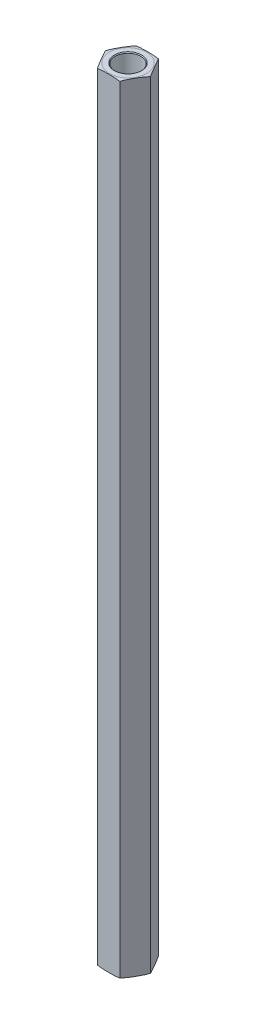
ISO-10303-21;
HEADER;
FILE_DESCRIPTION(('STEP AP214'),'2;1');
FILE_NAME('part.step','',(''),(''),'','','');
FILE_SCHEMA(('AUTOMOTIVE_DESIGN { 1 0 10303 214 1 1 1 1 }'));
ENDSEC;
DATA;
#1=APPLICATION_CONTEXT('core data for automotive mechanical design processes');
#2=APPLICATION_PROTOCOL_DEFINITION('international standard','automotive_design',2000,#1);
#3=PRODUCT_CONTEXT('',#1,'mechanical');
#4=PRODUCT('Part','Part','',(#3));
#5=PRODUCT_RELATED_PRODUCT_CATEGORY('part','',(#4));
#6=PRODUCT_DEFINITION_FORMATION('','',#4);
#7=PRODUCT_DEFINITION_CONTEXT('part definition',#1,'design');
#8=PRODUCT_DEFINITION('design','',#6,#7);
#9=PRODUCT_DEFINITION_SHAPE('','',#8);
#10=(LENGTH_UNIT() NAMED_UNIT(*) SI_UNIT(.MILLI.,.METRE.));
#11=(NAMED_UNIT(*) PLANE_ANGLE_UNIT() SI_UNIT($,.RADIAN.));
#12=(NAMED_UNIT(*) SI_UNIT($,.STERADIAN.) SOLID_ANGLE_UNIT());
#13=UNCERTAINTY_MEASURE_WITH_UNIT(LENGTH_MEASURE(1.E-05),#10,'distance_accuracy_value','');
#14=(GEOMETRIC_REPRESENTATION_CONTEXT(3) GLOBAL_UNCERTAINTY_ASSIGNED_CONTEXT((#13)) GLOBAL_UNIT_ASSIGNED_CONTEXT((#10,
#11,#12)) REPRESENTATION_CONTEXT('',''));
#15=CARTESIAN_POINT('',(0.,0.,0.));
#16=DIRECTION('',(0.,0.,1.));
#17=DIRECTION('',(1.,0.,0.));
#18=AXIS2_PLACEMENT_3D('',#15,#16,#17);
#19=CARTESIAN_POINT('',(0.,50.8,0.));
#20=DIRECTION('',(0.,1.,0.));
#21=DIRECTION('',(0.,0.,1.));
#22=AXIS2_PLACEMENT_3D('',#19,#20,#21);
#23=PLANE('',#22);
#24=CARTESIAN_POINT('',(0.,50.8,0.));
#25=DIRECTION('',(0.,1.,0.));
#26=DIRECTION('',(0.,0.,1.));
#27=AXIS2_PLACEMENT_3D('',#24,#25,#26);
#28=CIRCLE('',#27,2.0955);
#29=CARTESIAN_POINT('',(0.,50.8,2.0955));
#30=VERTEX_POINT('',#29);
#31=EDGE_CURVE('E303',#30,#30,#28,.T.);
#32=ORIENTED_EDGE('',*,*,#31,.T.);
#33=EDGE_LOOP('',(#32));
#34=FACE_BOUND('',#33,.T.);
#35=ADVANCED_FACE('F17',(#34),#23,.T.);
#36=CARTESIAN_POINT('',(0.,-50.8,0.));
#37=DIRECTION('',(0.,-1.,0.));
#38=DIRECTION('',(0.,0.,-1.));
#39=AXIS2_PLACEMENT_3D('',#36,#37,#38);
#40=PLANE('',#39);
#41=CARTESIAN_POINT('',(0.,-50.8,0.));
#42=DIRECTION('',(0.,-1.,0.));
#43=DIRECTION('',(0.,0.,-1.));
#44=AXIS2_PLACEMENT_3D('',#41,#42,#43);
#45=CIRCLE('',#44,2.0955);
#46=CARTESIAN_POINT('',(0.,-50.8,-2.0955));
#47=VERTEX_POINT('',#46);
#48=EDGE_CURVE('E437',#47,#47,#45,.T.);
#49=ORIENTED_EDGE('',*,*,#48,.T.);
#50=EDGE_LOOP('',(#49));
#51=FACE_BOUND('',#50,.T.);
#52=ADVANCED_FACE('F408',(#51),#40,.T.);
#53=CARTESIAN_POINT('',(0.,50.8,0.));
#54=DIRECTION('',(0.,1.,0.));
#55=DIRECTION('',(0.,0.,1.));
#56=AXIS2_PLACEMENT_3D('',#53,#54,#55);
#57=CYLINDRICAL_SURFACE('',#56,2.0955);
#58=CARTESIAN_POINT('',(0.,63.3729999999559,0.));
#59=DIRECTION('',(0.,1.,0.));
#60=DIRECTION('',(0.,0.,1.));
#61=AXIS2_PLACEMENT_3D('',#58,#59,#60);
#62=CIRCLE('',#61,2.09549999993897);
#63=CARTESIAN_POINT('',(0.,63.3729999999559,2.09549999993897));
#64=VERTEX_POINT('',#63);
#65=EDGE_CURVE('E439',#64,#64,#62,.T.);
#66=ORIENTED_EDGE('',*,*,#65,.T.);
#67=EDGE_LOOP('',(#66));
#68=FACE_BOUND('',#67,.T.);
#69=ORIENTED_EDGE('',*,*,#31,.F.);
#70=EDGE_LOOP('',(#69));
#71=FACE_BOUND('',#70,.T.);
#72=ADVANCED_FACE('F398',(#68,#71),#57,.F.);
#73=CARTESIAN_POINT('',(0.,-50.8,0.));
#74=DIRECTION('',(0.,-1.,0.));
#75=DIRECTION('',(0.,0.,-1.));
#76=AXIS2_PLACEMENT_3D('',#73,#74,#75);
#77=CYLINDRICAL_SURFACE('',#76,2.0955);
#78=ORIENTED_EDGE('',*,*,#48,.F.);
#79=EDGE_LOOP('',(#78));
#80=FACE_BOUND('',#79,.T.);
#81=CARTESIAN_POINT('',(0.,-63.3730000000128,0.));
#82=DIRECTION('',(0.,-1.,0.));
#83=DIRECTION('',(0.,0.,-1.));
#84=AXIS2_PLACEMENT_3D('',#81,#82,#83);
#85=CIRCLE('',#84,2.09550000005265);
#86=CARTESIAN_POINT('',(0.,-63.3730000000128,-2.09550000005265));
#87=VERTEX_POINT('',#86);
#88=EDGE_CURVE('E156',#87,#87,#85,.T.);
#89=ORIENTED_EDGE('',*,*,#88,.T.);
#90=EDGE_LOOP('',(#89));
#91=FACE_BOUND('',#90,.T.);
#92=ADVANCED_FACE('F388',(#80,#91),#77,.F.);
#93=CARTESIAN_POINT('',(0.,63.4999999999764,0.));
#94=DIRECTION('',(0.,1.,0.));
#95=DIRECTION('',(0.,0.,1.));
#96=AXIS2_PLACEMENT_3D('',#93,#94,#95);
#97=CONICAL_SURFACE('',#96,2.22249999995938,0.785398163397448);
#98=CARTESIAN_POINT('',(0.,63.5000000000332,0.));
#99=DIRECTION('',(0.,1.,0.));
#100=DIRECTION('',(0.,0.,1.));
#101=AXIS2_PLACEMENT_3D('',#98,#99,#100);
#102=CIRCLE('',#101,2.22250000001623);
#103=CARTESIAN_POINT('',(0.,63.5000000000332,2.22250000001623));
#104=VERTEX_POINT('',#103);
#105=EDGE_CURVE('E300',#104,#104,#102,.T.);
#106=ORIENTED_EDGE('',*,*,#105,.T.);
#107=EDGE_LOOP('',(#106));
#108=FACE_BOUND('',#107,.T.);
#109=ORIENTED_EDGE('',*,*,#65,.F.);
#110=EDGE_LOOP('',(#109));
#111=FACE_BOUND('',#110,.T.);
#112=ADVANCED_FACE('F323',(#108,#111),#97,.F.);
#113=CARTESIAN_POINT('',(3.66617420935412,63.5,0.));
#114=DIRECTION('',(-0.866025403784439,0.,0.5));
#115=DIRECTION('',(0.5,0.,0.866025403784439));
#116=AXIS2_PLACEMENT_3D('',#113,#114,#115);
#117=PLANE('',#116);
#118=DIRECTION('',(0.,1.,0.));
#119=VECTOR('',#118,1.);
#120=CARTESIAN_POINT('',(1.83308710467706,63.5,-3.175));
#121=LINE('',#120,#119);
#122=CARTESIAN_POINT('',(1.83308710467706,-63.373,-3.175));
#123=VERTEX_POINT('',#122);
#124=CARTESIAN_POINT('',(1.83308710467706,63.373,-3.175));
#125=VERTEX_POINT('',#124);
#126=EDGE_CURVE('E79',#123,#125,#121,.T.);
#127=ORIENTED_EDGE('',*,*,#126,.T.);
#128=CARTESIAN_POINT('',(3.66617420935412,63.373,0.));
#129=CARTESIAN_POINT('',(3.62797961467394,63.3889014148997,-0.0661549785605575));
#130=CARTESIAN_POINT('',(3.58956810864157,63.4024886076105,-0.132685658603875));
#131=CARTESIAN_POINT('',(3.51249051795711,63.4258161979402,-0.266187961794358));
#132=CARTESIAN_POINT('',(3.47382473049846,63.4355604771397,-0.333159070187389));
#133=CARTESIAN_POINT('',(3.39641631867873,63.4519966530451,-0.46723437239238));
#134=CARTESIAN_POINT('',(3.35767399633312,63.4586945328669,-0.534338043098183));
#135=CARTESIAN_POINT('',(3.28009834620113,63.4697767572932,-0.66870301055698));
#136=CARTESIAN_POINT('',(3.24126499587771,63.474160450474,-0.735964346345267));
#137=CARTESIAN_POINT('',(3.16354065964315,63.4812403004263,-0.870586845688097));
#138=CARTESIAN_POINT('',(3.12464965374476,63.4839355237591,-0.937948043861568));
#139=CARTESIAN_POINT('',(3.04685144594593,63.4881531983714,-1.07269849250694));
#140=CARTESIAN_POINT('',(3.00794424351969,63.4896756080272,-1.14008774388955));
#141=CARTESIAN_POINT('',(2.93051517598873,63.491922705889,-1.27419882283586));
#142=CARTESIAN_POINT('',(2.89199336248934,63.4926552468181,-1.34092056101649));
#143=CARTESIAN_POINT('',(2.81494778346144,63.4935767302574,-1.47436741839139));
#144=CARTESIAN_POINT('',(2.77642401791439,63.4937656658949,-1.54109253761774));
#145=CARTESIAN_POINT('',(2.69935964431012,63.4936659966806,-1.6745719481538));
#146=CARTESIAN_POINT('',(2.66081903631821,63.4933771811766,-1.74132623935039));
#147=CARTESIAN_POINT('',(2.5837390808533,63.492221986219,-1.87483263846077));
#148=CARTESIAN_POINT('',(2.54519973341245,63.4913555970386,-1.94158474631886));
#149=CARTESIAN_POINT('',(2.46812969629771,63.4887861940656,-2.07507396634282));
#150=CARTESIAN_POINT('',(2.42959900625965,63.4870832271616,-2.14181107913942));
#151=CARTESIAN_POINT('',(2.35255651340908,63.4824387229726,-2.27525259109836));
#152=CARTESIAN_POINT('',(2.31404470975443,63.4794972471358,-2.34195699171935));
#153=CARTESIAN_POINT('',(2.25084206239945,63.4732174124749,-2.45142718811103));
#154=CARTESIAN_POINT('',(2.2261384933701,63.4703980110463,-2.49421502479815));
#155=CARTESIAN_POINT('',(2.17676945272228,63.4638696794304,-2.57972471152111));
#156=CARTESIAN_POINT('',(2.15210397034183,63.4601610809139,-2.62244658019723));
#157=CARTESIAN_POINT('',(2.10282753811696,63.4516802711497,-2.70779586442644));
#158=CARTESIAN_POINT('',(2.07821657107529,63.4469084657008,-2.75042330976602));
#159=CARTESIAN_POINT('',(2.02900094683549,63.4360987712516,-2.83566727147556));
#160=CARTESIAN_POINT('',(2.00439646085463,63.4300577313084,-2.87828349128853));
#161=CARTESIAN_POINT('',(1.95527325900933,63.4165138354161,-2.96336737271505));
#162=CARTESIAN_POINT('',(1.93075459617614,63.409010197803,-3.00583494247579));
#163=CARTESIAN_POINT('',(1.88182157373171,63.3923203507084,-3.09058942351745));
#164=CARTESIAN_POINT('',(1.85740744053269,63.3831314978033,-3.1328759426409));
#165=CARTESIAN_POINT('',(1.83308710467706,63.373,-3.175));
#166=B_SPLINE_CURVE_WITH_KNOTS('',3,(#128,#129,#130,#131,#132,#133,#134,#135,#136,#137,#138,
#139,#140,#141,#142,#143,#144,#145,#146,#147,#148,#149,#150,#151,#152,#153,#154,#155,#156,#157,
#158,#159,#160,#161,#162,#163,#164,#165),.UNSPECIFIED.,.F.,.F.,(4,2,2,2,2,2,2,2,2,2,2,2,2,2,2,2,
2,2,4),(0.,0.233977307817942,0.467717675040691,0.700996973557496,0.934341903229746,
1.16781571967239,1.40129782179824,1.63243665809669,1.86357841666616,2.09482211846293,
2.32606971471494,2.55730435147396,2.78852751694412,2.93698369265086,3.08538458004473,
3.23372892334584,3.38244598546612,3.53124274626084,3.68027493713585),.UNSPECIFIED.);
#167=CARTESIAN_POINT('',(3.66617420935412,63.373,0.));
#168=VERTEX_POINT('',#167);
#169=EDGE_CURVE('E72',#168,#125,#166,.T.);
#170=ORIENTED_EDGE('',*,*,#169,.F.);
#171=DIRECTION('',(0.,1.,0.));
#172=VECTOR('',#171,1.);
#173=CARTESIAN_POINT('',(3.66617420935412,63.5,0.));
#174=LINE('',#173,#172);
#175=CARTESIAN_POINT('',(3.66617420935412,-63.373,0.));
#176=VERTEX_POINT('',#175);
#177=EDGE_CURVE('E76',#168,#176,#174,.F.);
#178=ORIENTED_EDGE('',*,*,#177,.T.);
#179=CARTESIAN_POINT('',(1.83308710467706,-63.373,-3.17499999999999));
#180=CARTESIAN_POINT('',(1.87128169935724,-63.3889014148997,-3.10884502143943));
#181=CARTESIAN_POINT('',(1.90969320538961,-63.4024886076105,-3.04231434139611));
#182=CARTESIAN_POINT('',(1.98677079607407,-63.4258161979402,-2.90881203820563));
#183=CARTESIAN_POINT('',(2.02543658353272,-63.4355604771397,-2.8418409298126));
#184=CARTESIAN_POINT('',(2.10284499535245,-63.4519966530451,-2.70776562760761));
#185=CARTESIAN_POINT('',(2.14158731769806,-63.4586945328669,-2.6406619569018));
#186=CARTESIAN_POINT('',(2.21916296783005,-63.4697767572932,-2.50629698944301));
#187=CARTESIAN_POINT('',(2.25799631815347,-63.474160450474,-2.43903565365472));
#188=CARTESIAN_POINT('',(2.33572065438804,-63.4812403004263,-2.30441315431189));
#189=CARTESIAN_POINT('',(2.37461166028642,-63.4839355237591,-2.23705195613842));
#190=CARTESIAN_POINT('',(2.45240986808526,-63.4881531983714,-2.10230150749304));
#191=CARTESIAN_POINT('',(2.49131707051149,-63.4896756080272,-2.03491225611043));
#192=CARTESIAN_POINT('',(2.56874613804245,-63.491922705889,-1.90080117716413));
#193=CARTESIAN_POINT('',(2.60726795154184,-63.4926552468181,-1.8340794389835));
#194=CARTESIAN_POINT('',(2.68431353056975,-63.4935767302574,-1.70063258160859));
#195=CARTESIAN_POINT('',(2.72283729611679,-63.4937656658949,-1.63390746238224));
#196=CARTESIAN_POINT('',(2.79990166972106,-63.4936659966806,-1.50042805184618));
#197=CARTESIAN_POINT('',(2.83844227771297,-63.4933771811766,-1.4336737606496));
#198=CARTESIAN_POINT('',(2.91552223317789,-63.492221986219,-1.30016736153921));
#199=CARTESIAN_POINT('',(2.95406158061873,-63.4913555970386,-1.23341525368112));
#200=CARTESIAN_POINT('',(3.03113161773348,-63.4887861940656,-1.09992603365716));
#201=CARTESIAN_POINT('',(3.06966230777154,-63.4870832271616,-1.03318892086056));
#202=CARTESIAN_POINT('',(3.1467048006221,-63.4824387229726,-0.899747408901616));
#203=CARTESIAN_POINT('',(3.18521660427676,-63.4794972471358,-0.833043008280631));
#204=CARTESIAN_POINT('',(3.24841925163174,-63.4732174124749,-0.723572811888948));
#205=CARTESIAN_POINT('',(3.27312282066109,-63.4703980110463,-0.680784975201834));
#206=CARTESIAN_POINT('',(3.32249186130891,-63.4638696794304,-0.595275288478877));
#207=CARTESIAN_POINT('',(3.34715734368935,-63.4601610809139,-0.552553419802754));
#208=CARTESIAN_POINT('',(3.39643377591422,-63.4516802711497,-0.467204135573548));
#209=CARTESIAN_POINT('',(3.42104474295589,-63.4469084657008,-0.424576690233975));
#210=CARTESIAN_POINT('',(3.47026036719568,-63.4360987712516,-0.339332728524437));
#211=CARTESIAN_POINT('',(3.49486485317655,-63.4300577313084,-0.296716508711467));
#212=CARTESIAN_POINT('',(3.54398805502185,-63.4165138354161,-0.211632627284948));
#213=CARTESIAN_POINT('',(3.56850671785504,-63.409010197803,-0.169165057524209));
#214=CARTESIAN_POINT('',(3.61743974029946,-63.3923203507084,-0.0844105764825525));
#215=CARTESIAN_POINT('',(3.64185387349848,-63.3831314978033,-0.0421240573591055));
#216=CARTESIAN_POINT('',(3.66617420935411,-63.373,0.));
#217=B_SPLINE_CURVE_WITH_KNOTS('',3,(#179,#180,#181,#182,#183,#184,#185,#186,#187,#188,#189,
#190,#191,#192,#193,#194,#195,#196,#197,#198,#199,#200,#201,#202,#203,#204,#205,#206,#207,#208,
#209,#210,#211,#212,#213,#214,#215,#216),.UNSPECIFIED.,.F.,.F.,(4,2,2,2,2,2,2,2,2,2,2,2,2,2,2,2,
2,2,4),(0.,0.233977307817943,0.467717675040694,0.7009969735575,0.934341903229751,
1.1678157196724,1.40129782179824,1.6324366580967,1.86357841666617,2.09482211846294,
2.32606971471495,2.55730435147398,2.78852751694413,2.93698369265087,3.08538458004473,
3.23372892334584,3.38244598546612,3.53124274626083,3.68027493713583),.UNSPECIFIED.);
#218=EDGE_CURVE('E90',#123,#176,#217,.T.);
#219=ORIENTED_EDGE('',*,*,#218,.F.);
#220=EDGE_LOOP('',(#127,#170,#178,#219));
#221=FACE_BOUND('',#220,.T.);
#222=ADVANCED_FACE('F74',(#221),#117,.F.);
#223=CARTESIAN_POINT('',(0.,-63.4999999999195,0.));
#224=DIRECTION('',(0.,-1.,0.));
#225=DIRECTION('',(0.,0.,-1.));
#226=AXIS2_PLACEMENT_3D('',#223,#224,#225);
#227=CONICAL_SURFACE('',#226,2.22249999995938,0.785398163397448);
#228=ORIENTED_EDGE('',*,*,#88,.F.);
#229=EDGE_LOOP('',(#228));
#230=FACE_BOUND('',#229,.T.);
#231=CARTESIAN_POINT('',(0.,-63.4999999999764,0.));
#232=DIRECTION('',(0.,-1.,0.));
#233=DIRECTION('',(0.,0.,-1.));
#234=AXIS2_PLACEMENT_3D('',#231,#232,#233);
#235=CIRCLE('',#234,2.22250000001623);
#236=CARTESIAN_POINT('',(0.,-63.4999999999764,-2.22250000001623));
#237=VERTEX_POINT('',#236);
#238=EDGE_CURVE('E280',#237,#237,#235,.F.);
#239=ORIENTED_EDGE('',*,*,#238,.F.);
#240=EDGE_LOOP('',(#239));
#241=FACE_BOUND('',#240,.T.);
#242=ADVANCED_FACE('F315',(#230,#241),#227,.F.);
#243=CARTESIAN_POINT('',(-1.83308710467707,63.5,-3.175));
#244=DIRECTION('',(0.,-1.,0.));
#245=DIRECTION('',(0.,0.,-1.));
#246=AXIS2_PLACEMENT_3D('',#243,#244,#245);
#247=PLANE('',#246);
#248=CARTESIAN_POINT('',(0.,63.5,0.));
#249=DIRECTION('',(0.,-1.,0.));
#250=DIRECTION('',(0.,0.,1.));
#251=AXIS2_PLACEMENT_3D('',#248,#249,#250);
#252=CIRCLE('',#251,3.03117420935412);
#253=CARTESIAN_POINT('',(0.,63.5,3.03117420935412));
#254=VERTEX_POINT('',#253);
#255=CARTESIAN_POINT('',(0.,63.5,-3.03117420935412));
#256=VERTEX_POINT('',#255);
#257=EDGE_CURVE('E132',#254,#256,#252,.T.);
#258=ORIENTED_EDGE('',*,*,#257,.F.);
#259=CARTESIAN_POINT('',(0.,63.5,0.));
#260=DIRECTION('',(0.,-1.,0.));
#261=DIRECTION('',(0.,0.,-1.));
#262=AXIS2_PLACEMENT_3D('',#259,#260,#261);
#263=CIRCLE('',#262,3.03117420935412);
#264=EDGE_CURVE('E83',#256,#254,#263,.T.);
#265=ORIENTED_EDGE('',*,*,#264,.F.);
#266=EDGE_LOOP('',(#258,#265));
#267=FACE_BOUND('',#266,.T.);
#268=ORIENTED_EDGE('',*,*,#105,.F.);
#269=EDGE_LOOP('',(#268));
#270=FACE_BOUND('',#269,.T.);
#271=ADVANCED_FACE('F118',(#267,#270),#247,.F.);
#272=CARTESIAN_POINT('',(1.83308710467706,63.5,3.17499999999999));
#273=DIRECTION('',(-0.866025403784439,0.,-0.5));
#274=DIRECTION('',(-0.5,0.,0.866025403784439));
#275=AXIS2_PLACEMENT_3D('',#272,#273,#274);
#276=PLANE('',#275);
#277=ORIENTED_EDGE('',*,*,#177,.F.);
#278=CARTESIAN_POINT('',(1.83308710467706,63.373,3.17499999999999));
#279=CARTESIAN_POINT('',(1.87128169935724,63.3889014148997,3.10884502143944));
#280=CARTESIAN_POINT('',(1.90969320538961,63.4024886076105,3.04231434139612));
#281=CARTESIAN_POINT('',(1.98677079607407,63.4258161979402,2.90881203820563));
#282=CARTESIAN_POINT('',(2.02543658353272,63.4355604771397,2.8418409298126));
#283=CARTESIAN_POINT('',(2.10284499535245,63.4519966530451,2.70776562760761));
#284=CARTESIAN_POINT('',(2.14158731769806,63.4586945328669,2.64066195690181));
#285=CARTESIAN_POINT('',(2.21916296783005,63.4697767572932,2.50629698944301));
#286=CARTESIAN_POINT('',(2.25799631815347,63.474160450474,2.43903565365473));
#287=CARTESIAN_POINT('',(2.33572065438803,63.4812403004263,2.3044131543119));
#288=CARTESIAN_POINT('',(2.37461166028642,63.4839355237591,2.23705195613843));
#289=CARTESIAN_POINT('',(2.45240986808525,63.4881531983714,2.10230150749305));
#290=CARTESIAN_POINT('',(2.49131707051149,63.4896756080272,2.03491225611044));
#291=CARTESIAN_POINT('',(2.56874613804245,63.491922705889,1.90080117716414));
#292=CARTESIAN_POINT('',(2.60726795154184,63.4926552468181,1.83407943898351));
#293=CARTESIAN_POINT('',(2.68431353056974,63.4935767302574,1.7006325816086));
#294=CARTESIAN_POINT('',(2.72283729611679,63.4937656658949,1.63390746238225));
#295=CARTESIAN_POINT('',(2.79990166972106,63.4936659966806,1.50042805184619));
#296=CARTESIAN_POINT('',(2.83844227771297,63.4933771811766,1.43367376064961));
#297=CARTESIAN_POINT('',(2.91552223317788,63.492221986219,1.30016736153923));
#298=CARTESIAN_POINT('',(2.95406158061873,63.4913555970386,1.23341525368113));
#299=CARTESIAN_POINT('',(3.03113161773347,63.4887861940656,1.09992603365717));
#300=CARTESIAN_POINT('',(3.06966230777153,63.4870832271616,1.03318892086057));
#301=CARTESIAN_POINT('',(3.1467048006221,63.4824387229726,0.89974740890163));
#302=CARTESIAN_POINT('',(3.18521660427676,63.4794972471358,0.833043008280645));
#303=CARTESIAN_POINT('',(3.24841925163173,63.4732174124749,0.723572811888962));
#304=CARTESIAN_POINT('',(3.27312282066108,63.4703980110463,0.680784975201847));
#305=CARTESIAN_POINT('',(3.3224918613089,63.4638696794304,0.595275288478887));
#306=CARTESIAN_POINT('',(3.34715734368935,63.4601610809139,0.552553419802764));
#307=CARTESIAN_POINT('',(3.39643377591422,63.4516802711497,0.467204135573556));
#308=CARTESIAN_POINT('',(3.42104474295589,63.4469084657008,0.424576690233982));
#309=CARTESIAN_POINT('',(3.47026036719568,63.4360987712516,0.339332728524442));
#310=CARTESIAN_POINT('',(3.49486485317655,63.4300577313084,0.296716508711471));
#311=CARTESIAN_POINT('',(3.54398805502185,63.4165138354161,0.211632627284951));
#312=CARTESIAN_POINT('',(3.56850671785504,63.409010197803,0.169165057524211));
#313=CARTESIAN_POINT('',(3.61743974029947,63.3923203507084,0.0844105764825526));
#314=CARTESIAN_POINT('',(3.64185387349848,63.3831314978033,0.0421240573591046));
#315=CARTESIAN_POINT('',(3.66617420935412,63.373,0.));
#316=B_SPLINE_CURVE_WITH_KNOTS('',3,(#278,#279,#280,#281,#282,#283,#284,#285,#286,#287,#288,
#289,#290,#291,#292,#293,#294,#295,#296,#297,#298,#299,#300,#301,#302,#303,#304,#305,#306,#307,
#308,#309,#310,#311,#312,#313,#314,#315),.UNSPECIFIED.,.F.,.F.,(4,2,2,2,2,2,2,2,2,2,2,2,2,2,2,2,
2,2,4),(0.,0.233977307817942,0.467717675040691,0.700996973557496,0.934341903229745,
1.16781571967239,1.40129782179824,1.63243665809669,1.86357841666616,2.09482211846293,
2.32606971471494,2.55730435147396,2.78852751694412,2.93698369265086,3.08538458004472,
3.23372892334583,3.38244598546612,3.53124274626083,3.68027493713584),.UNSPECIFIED.);
#317=CARTESIAN_POINT('',(1.83308710467706,63.373,3.17499999999999));
#318=VERTEX_POINT('',#317);
#319=EDGE_CURVE('E82',#318,#168,#316,.T.);
#320=ORIENTED_EDGE('',*,*,#319,.F.);
#321=DIRECTION('',(0.,1.,0.));
#322=VECTOR('',#321,1.);
#323=CARTESIAN_POINT('',(1.83308710467706,63.5,3.17499999999999));
#324=LINE('',#323,#322);
#325=CARTESIAN_POINT('',(1.83308710467706,-63.373,3.17499999999999));
#326=VERTEX_POINT('',#325);
#327=EDGE_CURVE('E179',#318,#326,#324,.F.);
#328=ORIENTED_EDGE('',*,*,#327,.T.);
#329=CARTESIAN_POINT('',(3.66617420935412,-63.373,0.));
#330=CARTESIAN_POINT('',(3.62797961467394,-63.3889014148997,0.0661549785605648));
#331=CARTESIAN_POINT('',(3.58956810864156,-63.4024886076105,0.132685658603882));
#332=CARTESIAN_POINT('',(3.5124905179571,-63.4258161979402,0.266187961794366));
#333=CARTESIAN_POINT('',(3.47382473049846,-63.4355604771397,0.333159070187397));
#334=CARTESIAN_POINT('',(3.39641631867873,-63.4519966530451,0.467234372392389));
#335=CARTESIAN_POINT('',(3.35767399633312,-63.4586945328669,0.534338043098192));
#336=CARTESIAN_POINT('',(3.28009834620113,-63.4697767572932,0.668703010556991));
#337=CARTESIAN_POINT('',(3.24126499587771,-63.474160450474,0.735964346345278));
#338=CARTESIAN_POINT('',(3.16354065964314,-63.4812403004263,0.870586845688109));
#339=CARTESIAN_POINT('',(3.12464965374475,-63.4839355237591,0.93794804386158));
#340=CARTESIAN_POINT('',(3.04685144594592,-63.4881531983714,1.07269849250696));
#341=CARTESIAN_POINT('',(3.00794424351969,-63.4896756080272,1.14008774388956));
#342=CARTESIAN_POINT('',(2.93051517598872,-63.491922705889,1.27419882283587));
#343=CARTESIAN_POINT('',(2.89199336248934,-63.4926552468181,1.3409205610165));
#344=CARTESIAN_POINT('',(2.81494778346143,-63.4935767302574,1.47436741839141));
#345=CARTESIAN_POINT('',(2.77642401791438,-63.4937656658949,1.54109253761776));
#346=CARTESIAN_POINT('',(2.69935964431012,-63.4936659966806,1.67457194815382));
#347=CARTESIAN_POINT('',(2.66081903631821,-63.4933771811766,1.7413262393504));
#348=CARTESIAN_POINT('',(2.58373908085329,-63.492221986219,1.87483263846079));
#349=CARTESIAN_POINT('',(2.54519973341244,-63.4913555970386,1.94158474631888));
#350=CARTESIAN_POINT('',(2.4681296962977,-63.4887861940656,2.07507396634284));
#351=CARTESIAN_POINT('',(2.42959900625964,-63.4870832271616,2.14181107913944));
#352=CARTESIAN_POINT('',(2.35255651340907,-63.4824387229726,2.27525259109838));
#353=CARTESIAN_POINT('',(2.31404470975442,-63.4794972471358,2.34195699171937));
#354=CARTESIAN_POINT('',(2.25084206239944,-63.4732174124749,2.45142718811105));
#355=CARTESIAN_POINT('',(2.22613849337009,-63.4703980110463,2.49421502479817));
#356=CARTESIAN_POINT('',(2.17676945272227,-63.4638696794304,2.57972471152112));
#357=CARTESIAN_POINT('',(2.15210397034183,-63.4601610809139,2.62244658019725));
#358=CARTESIAN_POINT('',(2.10282753811695,-63.4516802711497,2.70779586442645));
#359=CARTESIAN_POINT('',(2.07821657107529,-63.4469084657008,2.75042330976602));
#360=CARTESIAN_POINT('',(2.02900094683549,-63.4360987712516,2.83566727147556));
#361=CARTESIAN_POINT('',(2.00439646085463,-63.4300577313084,2.87828349128853));
#362=CARTESIAN_POINT('',(1.95527325900933,-63.4165138354161,2.96336737271505));
#363=CARTESIAN_POINT('',(1.93075459617614,-63.409010197803,3.00583494247579));
#364=CARTESIAN_POINT('',(1.88182157373171,-63.3923203507084,3.09058942351744));
#365=CARTESIAN_POINT('',(1.8574074405327,-63.3831314978033,3.13287594264089));
#366=CARTESIAN_POINT('',(1.83308710467706,-63.373,3.17499999999999));
#367=B_SPLINE_CURVE_WITH_KNOTS('',3,(#329,#330,#331,#332,#333,#334,#335,#336,#337,#338,#339,
#340,#341,#342,#343,#344,#345,#346,#347,#348,#349,#350,#351,#352,#353,#354,#355,#356,#357,#358,
#359,#360,#361,#362,#363,#364,#365,#366),.UNSPECIFIED.,.F.,.F.,(4,2,2,2,2,2,2,2,2,2,2,2,2,2,2,2,
2,2,4),(0.,0.233977307817943,0.467717675040693,0.7009969735575,0.934341903229751,
1.1678157196724,1.40129782179825,1.6324366580967,1.86357841666617,2.09482211846294,
2.32606971471495,2.55730435147398,2.78852751694413,2.93698369265087,3.08538458004473,
3.23372892334584,3.38244598546612,3.53124274626083,3.68027493713583),.UNSPECIFIED.);
#368=EDGE_CURVE('E89',#176,#326,#367,.T.);
#369=ORIENTED_EDGE('',*,*,#368,.F.);
#370=EDGE_LOOP('',(#277,#320,#328,#369));
#371=FACE_BOUND('',#370,.T.);
#372=ADVANCED_FACE('F86',(#371),#276,.F.);
#373=CARTESIAN_POINT('',(1.83308710467706,63.5,-3.175));
#374=DIRECTION('',(0.,0.,1.));
#375=DIRECTION('',(1.,0.,0.));
#376=AXIS2_PLACEMENT_3D('',#373,#374,#375);
#377=PLANE('',#376);
#378=DIRECTION('',(0.,1.,0.));
#379=VECTOR('',#378,1.);
#380=CARTESIAN_POINT('',(-1.83308710467708,63.5,-3.17499999999998));
#381=LINE('',#380,#379);
#382=CARTESIAN_POINT('',(-1.83308710467708,-63.373,-3.17499999999998));
#383=VERTEX_POINT('',#382);
#384=CARTESIAN_POINT('',(-1.83308710467706,63.373,-3.17500000000001));
#385=VERTEX_POINT('',#384);
#386=EDGE_CURVE('E181',#383,#385,#381,.T.);
#387=ORIENTED_EDGE('',*,*,#386,.T.);
#388=CARTESIAN_POINT('',(1.83308710467706,63.373,-3.17500000000001));
#389=CARTESIAN_POINT('',(1.73237579828683,63.3939400141518,-3.175));
#390=CARTESIAN_POINT('',(1.63096506893486,63.4108853495327,-3.175));
#391=CARTESIAN_POINT('',(1.42767146651469,63.4384971643984,-3.175));
#392=CARTESIAN_POINT('',(1.32579191427254,63.4491875658753,-3.175));
#393=CARTESIAN_POINT('',(1.12177634709138,63.4661280408079,-3.175));
#394=CARTESIAN_POINT('',(1.0196405664338,63.4723812707189,-3.175));
#395=CARTESIAN_POINT('',(0.815663681397375,63.4819028064183,-3.175));
#396=CARTESIAN_POINT('',(0.713823115514573,63.4851834044999,-3.175));
#397=CARTESIAN_POINT('',(0.510018485441651,63.4899454848703,-3.175));
#398=CARTESIAN_POINT('',(0.408054390577976,63.4914254100882,-3.175));
#399=CARTESIAN_POINT('',(0.20406020033787,63.4933146818379,-3.175));
#400=CARTESIAN_POINT('',(0.102030100168935,63.4937234241492,-3.175));
#401=CARTESIAN_POINT('',(-0.102030100168934,63.4937234241492,-3.175));
#402=CARTESIAN_POINT('',(-0.204060200337869,63.4933146818379,-3.175));
#403=CARTESIAN_POINT('',(-0.408054390577975,63.4914254100882,-3.175));
#404=CARTESIAN_POINT('',(-0.510018485441649,63.4899454848703,-3.175));
#405=CARTESIAN_POINT('',(-0.713823115514571,63.4851834044999,-3.175));
#406=CARTESIAN_POINT('',(-0.815663681397373,63.4819028064183,-3.175));
#407=CARTESIAN_POINT('',(-1.01964056643379,63.4723812707189,-3.175));
#408=CARTESIAN_POINT('',(-1.12177634709137,63.4661280408079,-3.175));
#409=CARTESIAN_POINT('',(-1.32579191427254,63.4491875658753,-3.175));
#410=CARTESIAN_POINT('',(-1.42767146651469,63.4384971643984,-3.175));
#411=CARTESIAN_POINT('',(-1.63096506893485,63.4108853495327,-3.175));
#412=CARTESIAN_POINT('',(-1.73237579828683,63.3939400141518,-3.175));
#413=CARTESIAN_POINT('',(-1.83308710467705,63.373,-3.175));
#414=B_SPLINE_CURVE_WITH_KNOTS('',3,(#388,#389,#390,#391,#392,#393,#394,#395,#396,#397,#398,
#399,#400,#401,#402,#403,#404,#405,#406,#407,#408,#409,#410,#411,#412,#413),.UNSPECIFIED.,.F.,
.F.,(4,2,2,2,2,2,2,2,2,2,2,2,4),(0.,0.308333242342807,0.615479423308233,0.922406891130008,
1.2280592962085,1.53397581645216,1.84006485747889,2.14615389850561,2.45207041874927,
2.75772282382776,3.06465029164954,3.37179647261496,3.68012971495777),.UNSPECIFIED.);
#415=EDGE_CURVE('E184',#125,#385,#414,.T.);
#416=ORIENTED_EDGE('',*,*,#415,.F.);
#417=ORIENTED_EDGE('',*,*,#126,.F.);
#418=CARTESIAN_POINT('',(-1.83308710467707,-63.373,-3.175));
#419=CARTESIAN_POINT('',(-1.73237579828684,-63.3939400141518,-3.175));
#420=CARTESIAN_POINT('',(-1.63096506893487,-63.4108853495327,-3.175));
#421=CARTESIAN_POINT('',(-1.4276714665147,-63.4384971643984,-3.175));
#422=CARTESIAN_POINT('',(-1.32579191427255,-63.4491875658753,-3.175));
#423=CARTESIAN_POINT('',(-1.12177634709138,-63.4661280408079,-3.175));
#424=CARTESIAN_POINT('',(-1.0196405664338,-63.4723812707189,-3.175));
#425=CARTESIAN_POINT('',(-0.81566368139738,-63.4819028064183,-3.175));
#426=CARTESIAN_POINT('',(-0.713823115514577,-63.4851834044999,-3.175));
#427=CARTESIAN_POINT('',(-0.510018485441654,-63.4899454848703,-3.175));
#428=CARTESIAN_POINT('',(-0.408054390577979,-63.4914254100882,-3.175));
#429=CARTESIAN_POINT('',(-0.204060200337872,-63.4933146818379,-3.175));
#430=CARTESIAN_POINT('',(-0.102030100168936,-63.4937234241492,-3.175));
#431=CARTESIAN_POINT('',(0.102030100168935,-63.4937234241492,-3.175));
#432=CARTESIAN_POINT('',(0.20406020033787,-63.4933146818379,-3.175));
#433=CARTESIAN_POINT('',(0.408054390577976,-63.4914254100882,-3.175));
#434=CARTESIAN_POINT('',(0.510018485441651,-63.4899454848703,-3.175));
#435=CARTESIAN_POINT('',(0.713823115514573,-63.4851834044999,-3.175));
#436=CARTESIAN_POINT('',(0.815663681397375,-63.4819028064183,-3.175));
#437=CARTESIAN_POINT('',(1.0196405664338,-63.4723812707189,-3.175));
#438=CARTESIAN_POINT('',(1.12177634709137,-63.4661280408079,-3.175));
#439=CARTESIAN_POINT('',(1.32579191427254,-63.4491875658753,-3.175));
#440=CARTESIAN_POINT('',(1.42767146651469,-63.4384971643984,-3.175));
#441=CARTESIAN_POINT('',(1.63096506893486,-63.4108853495327,-3.175));
#442=CARTESIAN_POINT('',(1.73237579828683,-63.3939400141518,-3.175));
#443=CARTESIAN_POINT('',(1.83308710467706,-63.373,-3.17500000000001));
#444=B_SPLINE_CURVE_WITH_KNOTS('',3,(#418,#419,#420,#421,#422,#423,#424,#425,#426,#427,#428,
#429,#430,#431,#432,#433,#434,#435,#436,#437,#438,#439,#440,#441,#442,#443),.UNSPECIFIED.,.F.,
.F.,(4,2,2,2,2,2,2,2,2,2,2,2,4),(0.,0.308333242342808,0.615479423308236,0.922406891130012,
1.22805929620851,1.53397581645217,1.8400648574789,2.14615389850562,2.45207041874928,
2.75772282382777,3.06465029164955,3.37179647261498,3.68012971495778),.UNSPECIFIED.);
#445=EDGE_CURVE('E263',#383,#123,#444,.T.);
#446=ORIENTED_EDGE('',*,*,#445,.F.);
#447=EDGE_LOOP('',(#387,#416,#417,#446));
#448=FACE_BOUND('',#447,.T.);
#449=ADVANCED_FACE('F206',(#448),#377,.F.);
#450=CARTESIAN_POINT('',(-1.83308710467707,-63.5,-3.175));
#451=DIRECTION('',(0.,-1.,0.));
#452=DIRECTION('',(0.,0.,-1.));
#453=AXIS2_PLACEMENT_3D('',#450,#451,#452);
#454=PLANE('',#453);
#455=CARTESIAN_POINT('',(0.,-63.5,0.));
#456=DIRECTION('',(0.,1.,0.));
#457=DIRECTION('',(0.,0.,1.));
#458=AXIS2_PLACEMENT_3D('',#455,#456,#457);
#459=CIRCLE('',#458,3.03117420935412);
#460=CARTESIAN_POINT('',(0.,-63.5,-3.03117420935412));
#461=VERTEX_POINT('',#460);
#462=CARTESIAN_POINT('',(0.,-63.5,3.03117420935412));
#463=VERTEX_POINT('',#462);
#464=EDGE_CURVE('E185',#461,#463,#459,.F.);
#465=ORIENTED_EDGE('',*,*,#464,.T.);
#466=CARTESIAN_POINT('',(0.,-63.5,0.));
#467=DIRECTION('',(0.,1.,0.));
#468=DIRECTION('',(0.,0.,-1.));
#469=AXIS2_PLACEMENT_3D('',#466,#467,#468);
#470=CIRCLE('',#469,3.03117420935412);
#471=EDGE_CURVE('E219',#461,#463,#470,.T.);
#472=ORIENTED_EDGE('',*,*,#471,.F.);
#473=EDGE_LOOP('',(#465,#472));
#474=FACE_BOUND('',#473,.T.);
#475=ORIENTED_EDGE('',*,*,#238,.T.);
#476=EDGE_LOOP('',(#475));
#477=FACE_BOUND('',#476,.T.);
#478=ADVANCED_FACE('F197',(#474,#477),#454,.T.);
#479=CARTESIAN_POINT('',(-1.83308710467707,63.5,-3.175));
#480=DIRECTION('',(0.866025403784439,0.,0.5));
#481=DIRECTION('',(0.5,0.,-0.866025403784439));
#482=AXIS2_PLACEMENT_3D('',#479,#480,#481);
#483=PLANE('',#482);
#484=DIRECTION('',(0.,1.,0.));
#485=VECTOR('',#484,1.);
#486=CARTESIAN_POINT('',(-3.66617420935413,63.5,0.));
#487=LINE('',#486,#485);
#488=CARTESIAN_POINT('',(-3.66617420935412,-63.373,0.));
#489=VERTEX_POINT('',#488);
#490=CARTESIAN_POINT('',(-3.66617420935412,63.373,0.));
#491=VERTEX_POINT('',#490);
#492=EDGE_CURVE('E239',#489,#491,#487,.T.);
#493=ORIENTED_EDGE('',*,*,#492,.T.);
#494=CARTESIAN_POINT('',(-1.83308710467706,63.373,-3.17500000000001));
#495=CARTESIAN_POINT('',(-1.87128169935723,63.3889014148997,-3.10884502143945));
#496=CARTESIAN_POINT('',(-1.90969320538961,63.4024886076105,-3.04231434139614));
#497=CARTESIAN_POINT('',(-1.98677079607407,63.4258161979402,-2.90881203820566));
#498=CARTESIAN_POINT('',(-2.02543658353271,63.4355604771397,-2.84184092981263));
#499=CARTESIAN_POINT('',(-2.10284499535244,63.4519966530451,-2.70776562760765));
#500=CARTESIAN_POINT('',(-2.14158731769805,63.4586945328669,-2.64066195690185));
#501=CARTESIAN_POINT('',(-2.21916296783003,63.4697767572932,-2.50629698944305));
#502=CARTESIAN_POINT('',(-2.25799631815345,63.474160450474,-2.43903565365477));
#503=CARTESIAN_POINT('',(-2.33572065438801,63.4812403004263,-2.30441315431194));
#504=CARTESIAN_POINT('',(-2.3746116602864,63.4839355237591,-2.23705195613847));
#505=CARTESIAN_POINT('',(-2.45240986808523,63.4881531983714,-2.1023015074931));
#506=CARTESIAN_POINT('',(-2.49131707051147,63.4896756080272,-2.0349122561105));
#507=CARTESIAN_POINT('',(-2.56874613804243,63.491922705889,-1.90080117716419));
#508=CARTESIAN_POINT('',(-2.60726795154181,63.4926552468181,-1.83407943898356));
#509=CARTESIAN_POINT('',(-2.68431353056972,63.4935767302574,-1.70063258160867));
#510=CARTESIAN_POINT('',(-2.72283729611676,63.4937656658949,-1.63390746238232));
#511=CARTESIAN_POINT('',(-2.79990166972103,63.4936659966806,-1.50042805184626));
#512=CARTESIAN_POINT('',(-2.83844227771293,63.4933771811766,-1.43367376064968));
#513=CARTESIAN_POINT('',(-2.91552223317785,63.492221986219,-1.3001673615393));
#514=CARTESIAN_POINT('',(-2.95406158061869,63.4913555970386,-1.23341525368121));
#515=CARTESIAN_POINT('',(-3.03113161773343,63.4887861940656,-1.09992603365726));
#516=CARTESIAN_POINT('',(-3.06966230777149,63.4870832271616,-1.03318892086066));
#517=CARTESIAN_POINT('',(-3.14670480062205,63.4824387229726,-0.899747408901719));
#518=CARTESIAN_POINT('',(-3.18521660427671,63.4794972471358,-0.833043008280736));
#519=CARTESIAN_POINT('',(-3.24841925163169,63.4732174124749,-0.723572811889049));
#520=CARTESIAN_POINT('',(-3.27312282066104,63.4703980110463,-0.680784975201928));
#521=CARTESIAN_POINT('',(-3.32249186130887,63.4638696794304,-0.595275288478958));
#522=CARTESIAN_POINT('',(-3.34715734368932,63.4601610809139,-0.552553419802829));
#523=CARTESIAN_POINT('',(-3.3964337759142,63.4516802711497,-0.46720413557361));
#524=CARTESIAN_POINT('',(-3.42104474295587,63.4469084657009,-0.42457669023403));
#525=CARTESIAN_POINT('',(-3.47026036719567,63.4360987712516,-0.339332728524479));
#526=CARTESIAN_POINT('',(-3.49486485317654,63.4300577313084,-0.296716508711504));
#527=CARTESIAN_POINT('',(-3.54398805502184,63.4165138354161,-0.211632627284973));
#528=CARTESIAN_POINT('',(-3.56850671785504,63.409010197803,-0.169165057524227));
#529=CARTESIAN_POINT('',(-3.61743974029947,63.3923203507084,-0.0844105764825576));
#530=CARTESIAN_POINT('',(-3.64185387349849,63.3831314978033,-0.0421240573591044));
#531=CARTESIAN_POINT('',(-3.66617420935413,63.373,0.));
#532=B_SPLINE_CURVE_WITH_KNOTS('',3,(#494,#495,#496,#497,#498,#499,#500,#501,#502,#503,#504,
#505,#506,#507,#508,#509,#510,#511,#512,#513,#514,#515,#516,#517,#518,#519,#520,#521,#522,#523,
#524,#525,#526,#527,#528,#529,#530,#531),.UNSPECIFIED.,.F.,.F.,(4,2,2,2,2,2,2,2,2,2,2,2,2,2,2,2,
2,2,4),(0.,0.233977307817932,0.467717675040676,0.700996973557473,0.934341903229715,
1.16781571967235,1.40129782179819,1.63243665809664,1.8635784166661,2.09482211846287,
2.32606971471486,2.55730435147388,2.78852751694403,2.93698369265079,3.08538458004467,
3.2337289233458,3.3824459854661,3.53124274626084,3.68027493713587),.UNSPECIFIED.);
#533=EDGE_CURVE('E271',#385,#491,#532,.T.);
#534=ORIENTED_EDGE('',*,*,#533,.F.);
#535=ORIENTED_EDGE('',*,*,#386,.F.);
#536=CARTESIAN_POINT('',(-3.66617420935412,-63.373,0.));
#537=CARTESIAN_POINT('',(-3.62797961467395,-63.3889014148997,-0.0661549785605691));
#538=CARTESIAN_POINT('',(-3.58956810864157,-63.4024886076105,-0.132685658603886));
#539=CARTESIAN_POINT('',(-3.51249051795711,-63.4258161979402,-0.266187961794369));
#540=CARTESIAN_POINT('',(-3.47382473049847,-63.4355604771397,-0.3331590701874));
#541=CARTESIAN_POINT('',(-3.39641631867874,-63.4519966530451,-0.46723437239239));
#542=CARTESIAN_POINT('',(-3.35767399633313,-63.4586945328669,-0.534338043098193));
#543=CARTESIAN_POINT('',(-3.28009834620114,-63.4697767572932,-0.66870301055699));
#544=CARTESIAN_POINT('',(-3.24126499587772,-63.474160450474,-0.735964346345277));
#545=CARTESIAN_POINT('',(-3.16354065964315,-63.4812403004263,-0.870586845688106));
#546=CARTESIAN_POINT('',(-3.12464965374476,-63.4839355237591,-0.937948043861577));
#547=CARTESIAN_POINT('',(-3.04685144594593,-63.4881531983714,-1.07269849250695));
#548=CARTESIAN_POINT('',(-3.0079442435197,-63.4896756080272,-1.14008774388956));
#549=CARTESIAN_POINT('',(-2.93051517598874,-63.491922705889,-1.27419882283587));
#550=CARTESIAN_POINT('',(-2.89199336248935,-63.4926552468181,-1.3409205610165));
#551=CARTESIAN_POINT('',(-2.81494778346144,-63.4935767302574,-1.4743674183914));
#552=CARTESIAN_POINT('',(-2.7764240179144,-63.4937656658949,-1.54109253761775));
#553=CARTESIAN_POINT('',(-2.69935964431013,-63.4936659966806,-1.67457194815381));
#554=CARTESIAN_POINT('',(-2.66081903631822,-63.4933771811766,-1.7413262393504));
#555=CARTESIAN_POINT('',(-2.5837390808533,-63.492221986219,-1.87483263846078));
#556=CARTESIAN_POINT('',(-2.54519973341246,-63.4913555970386,-1.94158474631887));
#557=CARTESIAN_POINT('',(-2.46812969629771,-63.4887861940656,-2.07507396634283));
#558=CARTESIAN_POINT('',(-2.42959900625966,-63.4870832271616,-2.14181107913943));
#559=CARTESIAN_POINT('',(-2.35255651340909,-63.4824387229726,-2.27525259109837));
#560=CARTESIAN_POINT('',(-2.31404470975443,-63.4794972471358,-2.34195699171936));
#561=CARTESIAN_POINT('',(-2.25084206239946,-63.4732174124749,-2.45142718811104));
#562=CARTESIAN_POINT('',(-2.22613849337011,-63.4703980110463,-2.49421502479815));
#563=CARTESIAN_POINT('',(-2.17676945272229,-63.4638696794304,-2.57972471152111));
#564=CARTESIAN_POINT('',(-2.15210397034184,-63.4601610809139,-2.62244658019723));
#565=CARTESIAN_POINT('',(-2.10282753811697,-63.4516802711497,-2.70779586442644));
#566=CARTESIAN_POINT('',(-2.0782165710753,-63.4469084657008,-2.75042330976601));
#567=CARTESIAN_POINT('',(-2.02900094683551,-63.4360987712516,-2.83566727147555));
#568=CARTESIAN_POINT('',(-2.00439646085465,-63.4300577313084,-2.87828349128852));
#569=CARTESIAN_POINT('',(-1.95527325900935,-63.4165138354161,-2.96336737271504));
#570=CARTESIAN_POINT('',(-1.93075459617616,-63.409010197803,-3.00583494247578));
#571=CARTESIAN_POINT('',(-1.88182157373173,-63.3923203507084,-3.09058942351743));
#572=CARTESIAN_POINT('',(-1.85740744053272,-63.3831314978033,-3.13287594264088));
#573=CARTESIAN_POINT('',(-1.83308710467708,-63.373,-3.17499999999998));
#574=B_SPLINE_CURVE_WITH_KNOTS('',3,(#536,#537,#538,#539,#540,#541,#542,#543,#544,#545,#546,
#547,#548,#549,#550,#551,#552,#553,#554,#555,#556,#557,#558,#559,#560,#561,#562,#563,#564,#565,
#566,#567,#568,#569,#570,#571,#572,#573),.UNSPECIFIED.,.F.,.F.,(4,2,2,2,2,2,2,2,2,2,2,2,2,2,2,2,
2,2,4),(0.,0.233977307817941,0.46771767504069,0.700996973557493,0.934341903229743,
1.16781571967239,1.40129782179824,1.63243665809669,1.86357841666616,2.09482211846293,
2.32606971471493,2.55730435147396,2.78852751694411,2.93698369265085,3.08538458004471,
3.23372892334582,3.3824459854661,3.53124274626081,3.68027493713581),.UNSPECIFIED.);
#575=EDGE_CURVE('E243',#489,#383,#574,.T.);
#576=ORIENTED_EDGE('',*,*,#575,.F.);
#577=EDGE_LOOP('',(#493,#534,#535,#576));
#578=FACE_BOUND('',#577,.T.);
#579=ADVANCED_FACE('F169',(#578),#483,.F.);
#580=CARTESIAN_POINT('',(0.,61.849,0.));
#581=DIRECTION('',(0.,1.,0.));
#582=DIRECTION('',(0.,0.,1.));
#583=AXIS2_PLACEMENT_3D('',#580,#581,#582);
#584=TOROIDAL_SURFACE('',#583,3.03117420935412,1.65099999999997);
#585=ORIENTED_EDGE('',*,*,#169,.T.);
#586=ORIENTED_EDGE('',*,*,#415,.T.);
#587=ORIENTED_EDGE('',*,*,#533,.T.);
#588=CARTESIAN_POINT('',(-3.66617420935412,63.373,0.));
#589=CARTESIAN_POINT('',(-3.62797961467395,63.3889014148997,0.066154978560565));
#590=CARTESIAN_POINT('',(-3.58956810864157,63.4024886076105,0.132685658603882));
#591=CARTESIAN_POINT('',(-3.51249051795711,63.4258161979402,0.266187961794366));
#592=CARTESIAN_POINT('',(-3.47382473049846,63.4355604771397,0.333159070187397));
#593=CARTESIAN_POINT('',(-3.39641631867873,63.4519966530451,0.467234372392388));
#594=CARTESIAN_POINT('',(-3.35767399633313,63.4586945328669,0.534338043098191));
#595=CARTESIAN_POINT('',(-3.28009834620113,63.4697767572932,0.668703010556989));
#596=CARTESIAN_POINT('',(-3.24126499587771,63.474160450474,0.735964346345277));
#597=CARTESIAN_POINT('',(-3.16354065964315,63.4812403004263,0.870586845688107));
#598=CARTESIAN_POINT('',(-3.12464965374476,63.4839355237591,0.937948043861578));
#599=CARTESIAN_POINT('',(-3.04685144594593,63.4881531983714,1.07269849250696));
#600=CARTESIAN_POINT('',(-3.00794424351969,63.4896756080272,1.14008774388956));
#601=CARTESIAN_POINT('',(-2.93051517598873,63.491922705889,1.27419882283587));
#602=CARTESIAN_POINT('',(-2.89199336248934,63.4926552468181,1.3409205610165));
#603=CARTESIAN_POINT('',(-2.81494778346143,63.4935767302574,1.4743674183914));
#604=CARTESIAN_POINT('',(-2.77642401791439,63.4937656658949,1.54109253761776));
#605=CARTESIAN_POINT('',(-2.69935964431012,63.4936659966806,1.67457194815382));
#606=CARTESIAN_POINT('',(-2.66081903631821,63.4933771811766,1.7413262393504));
#607=CARTESIAN_POINT('',(-2.5837390808533,63.492221986219,1.87483263846078));
#608=CARTESIAN_POINT('',(-2.54519973341245,63.4913555970386,1.94158474631888));
#609=CARTESIAN_POINT('',(-2.46812969629771,63.4887861940656,2.07507396634284));
#610=CARTESIAN_POINT('',(-2.42959900625965,63.4870832271616,2.14181107913944));
#611=CARTESIAN_POINT('',(-2.35255651340908,63.4824387229726,2.27525259109838));
#612=CARTESIAN_POINT('',(-2.31404470975442,63.4794972471358,2.34195699171937));
#613=CARTESIAN_POINT('',(-2.25084206239945,63.4732174124749,2.45142718811105));
#614=CARTESIAN_POINT('',(-2.2261384933701,63.4703980110463,2.49421502479816));
#615=CARTESIAN_POINT('',(-2.17676945272228,63.4638696794304,2.57972471152112));
#616=CARTESIAN_POINT('',(-2.15210397034183,63.4601610809139,2.62244658019725));
#617=CARTESIAN_POINT('',(-2.10282753811696,63.4516802711497,2.70779586442645));
#618=CARTESIAN_POINT('',(-2.07821657107529,63.4469084657008,2.75042330976603));
#619=CARTESIAN_POINT('',(-2.0290009468355,63.4360987712516,2.83566727147557));
#620=CARTESIAN_POINT('',(-2.00439646085464,63.4300577313084,2.87828349128854));
#621=CARTESIAN_POINT('',(-1.95527325900934,63.4165138354161,2.96336737271506));
#622=CARTESIAN_POINT('',(-1.93075459617614,63.409010197803,3.0058349424758));
#623=CARTESIAN_POINT('',(-1.88182157373172,63.3923203507084,3.09058942351745));
#624=CARTESIAN_POINT('',(-1.8574074405327,63.3831314978033,3.1328759426409));
#625=CARTESIAN_POINT('',(-1.83308710467707,63.373,3.175));
#626=B_SPLINE_CURVE_WITH_KNOTS('',3,(#588,#589,#590,#591,#592,#593,#594,#595,#596,#597,#598,
#599,#600,#601,#602,#603,#604,#605,#606,#607,#608,#609,#610,#611,#612,#613,#614,#615,#616,#617,
#618,#619,#620,#621,#622,#623,#624,#625),.UNSPECIFIED.,.F.,.F.,(4,2,2,2,2,2,2,2,2,2,2,2,2,2,2,2,
2,2,4),(0.,0.233977307817942,0.467717675040692,0.700996973557497,0.934341903229748,
1.16781571967239,1.40129782179824,1.63243665809669,1.86357841666617,2.09482211846294,
2.32606971471495,2.55730435147398,2.78852751694413,2.93698369265087,3.08538458004473,
3.23372892334584,3.38244598546612,3.53124274626083,3.68027493713584),.UNSPECIFIED.);
#627=CARTESIAN_POINT('',(-1.83308710467706,63.373,3.175));
#628=VERTEX_POINT('',#627);
#629=EDGE_CURVE('E242',#491,#628,#626,.T.);
#630=ORIENTED_EDGE('',*,*,#629,.T.);
#631=CARTESIAN_POINT('',(-1.83308710467706,63.373,3.175));
#632=CARTESIAN_POINT('',(-1.73237579828684,63.3939400141518,3.175));
#633=CARTESIAN_POINT('',(-1.63096506893486,63.4108853495327,3.175));
#634=CARTESIAN_POINT('',(-1.42767146651469,63.4384971643984,3.175));
#635=CARTESIAN_POINT('',(-1.32579191427254,63.4491875658753,3.175));
#636=CARTESIAN_POINT('',(-1.12177634709138,63.4661280408079,3.175));
#637=CARTESIAN_POINT('',(-1.0196405664338,63.4723812707189,3.175));
#638=CARTESIAN_POINT('',(-0.815663681397378,63.4819028064183,3.175));
#639=CARTESIAN_POINT('',(-0.713823115514575,63.4851834044999,3.175));
#640=CARTESIAN_POINT('',(-0.510018485441653,63.4899454848703,3.175));
#641=CARTESIAN_POINT('',(-0.408054390577978,63.4914254100882,3.175));
#642=CARTESIAN_POINT('',(-0.204060200337871,63.4933146818379,3.175));
#643=CARTESIAN_POINT('',(-0.102030100168935,63.4937234241492,3.175));
#644=CARTESIAN_POINT('',(0.102030100168935,63.4937234241492,3.175));
#645=CARTESIAN_POINT('',(0.204060200337871,63.4933146818379,3.17499999999999));
#646=CARTESIAN_POINT('',(0.408054390577978,63.4914254100882,3.17499999999999));
#647=CARTESIAN_POINT('',(0.510018485441653,63.4899454848703,3.17499999999999));
#648=CARTESIAN_POINT('',(0.713823115514576,63.4851834044999,3.17499999999999));
#649=CARTESIAN_POINT('',(0.815663681397379,63.4819028064183,3.17499999999999));
#650=CARTESIAN_POINT('',(1.0196405664338,63.4723812707189,3.17499999999999));
#651=CARTESIAN_POINT('',(1.12177634709138,63.4661280408079,3.17499999999999));
#652=CARTESIAN_POINT('',(1.32579191427254,63.4491875658753,3.17499999999999));
#653=CARTESIAN_POINT('',(1.4276714665147,63.4384971643984,3.17499999999999));
#654=CARTESIAN_POINT('',(1.63096506893486,63.4108853495327,3.17499999999999));
#655=CARTESIAN_POINT('',(1.73237579828684,63.3939400141518,3.17499999999999));
#656=CARTESIAN_POINT('',(1.83308710467706,63.373,3.17499999999999));
#657=B_SPLINE_CURVE_WITH_KNOTS('',3,(#631,#632,#633,#634,#635,#636,#637,#638,#639,#640,#641,
#642,#643,#644,#645,#646,#647,#648,#649,#650,#651,#652,#653,#654,#655,#656),.UNSPECIFIED.,.F.,
.F.,(4,2,2,2,2,2,2,2,2,2,2,2,4),(0.,0.308333242342807,0.615479423308236,0.922406891130011,
1.2280592962085,1.53397581645216,1.84006485747889,2.14615389850562,2.45207041874928,
2.75772282382777,3.06465029164955,3.37179647261498,3.68012971495779),.UNSPECIFIED.);
#658=EDGE_CURVE('E96',#628,#318,#657,.T.);
#659=ORIENTED_EDGE('',*,*,#658,.T.);
#660=ORIENTED_EDGE('',*,*,#319,.T.);
#661=EDGE_LOOP('',(#585,#586,#587,#630,#659,#660));
#662=FACE_BOUND('',#661,.T.);
#663=ORIENTED_EDGE('',*,*,#257,.T.);
#664=ORIENTED_EDGE('',*,*,#264,.T.);
#665=EDGE_LOOP('',(#663,#664));
#666=FACE_BOUND('',#665,.T.);
#667=ADVANCED_FACE('F93',(#662,#666),#584,.T.);
#668=CARTESIAN_POINT('',(-1.83308710467707,63.5,3.175));
#669=DIRECTION('',(0.,0.,-1.));
#670=DIRECTION('',(-1.,0.,0.));
#671=AXIS2_PLACEMENT_3D('',#668,#669,#670);
#672=PLANE('',#671);
#673=ORIENTED_EDGE('',*,*,#327,.F.);
#674=ORIENTED_EDGE('',*,*,#658,.F.);
#675=DIRECTION('',(0.,1.,0.));
#676=VECTOR('',#675,1.);
#677=CARTESIAN_POINT('',(-1.83308710467707,63.5,3.175));
#678=LINE('',#677,#676);
#679=CARTESIAN_POINT('',(-1.83308710467708,-63.373,3.17499999999999));
#680=VERTEX_POINT('',#679);
#681=EDGE_CURVE('E28',#628,#680,#678,.F.);
#682=ORIENTED_EDGE('',*,*,#681,.T.);
#683=CARTESIAN_POINT('',(1.83308710467706,-63.373,3.17499999999999));
#684=CARTESIAN_POINT('',(1.73237579828683,-63.3939400141518,3.17499999999999));
#685=CARTESIAN_POINT('',(1.63096506893486,-63.4108853495327,3.17499999999999));
#686=CARTESIAN_POINT('',(1.42767146651469,-63.4384971643984,3.17499999999999));
#687=CARTESIAN_POINT('',(1.32579191427254,-63.4491875658753,3.17499999999999));
#688=CARTESIAN_POINT('',(1.12177634709138,-63.4661280408079,3.17499999999999));
#689=CARTESIAN_POINT('',(1.0196405664338,-63.4723812707189,3.17499999999999));
#690=CARTESIAN_POINT('',(0.815663681397378,-63.4819028064183,3.17499999999999));
#691=CARTESIAN_POINT('',(0.713823115514575,-63.4851834044999,3.17499999999999));
#692=CARTESIAN_POINT('',(0.510018485441652,-63.4899454848703,3.17499999999999));
#693=CARTESIAN_POINT('',(0.408054390577977,-63.4914254100882,3.17499999999999));
#694=CARTESIAN_POINT('',(0.204060200337871,-63.4933146818379,3.17499999999999));
#695=CARTESIAN_POINT('',(0.102030100168935,-63.4937234241492,3.175));
#696=CARTESIAN_POINT('',(-0.102030100168936,-63.4937234241492,3.175));
#697=CARTESIAN_POINT('',(-0.204060200337872,-63.4933146818379,3.175));
#698=CARTESIAN_POINT('',(-0.40805439057798,-63.4914254100882,3.175));
#699=CARTESIAN_POINT('',(-0.510018485441656,-63.4899454848703,3.175));
#700=CARTESIAN_POINT('',(-0.71382311551458,-63.4851834044999,3.175));
#701=CARTESIAN_POINT('',(-0.815663681397383,-63.4819028064183,3.175));
#702=CARTESIAN_POINT('',(-1.0196405664338,-63.4723812707189,3.175));
#703=CARTESIAN_POINT('',(-1.12177634709138,-63.4661280408079,3.175));
#704=CARTESIAN_POINT('',(-1.32579191427255,-63.4491875658753,3.175));
#705=CARTESIAN_POINT('',(-1.4276714665147,-63.4384971643984,3.175));
#706=CARTESIAN_POINT('',(-1.63096506893487,-63.4108853495327,3.175));
#707=CARTESIAN_POINT('',(-1.73237579828685,-63.3939400141518,3.175));
#708=CARTESIAN_POINT('',(-1.83308710467707,-63.373,3.175));
#709=B_SPLINE_CURVE_WITH_KNOTS('',3,(#683,#684,#685,#686,#687,#688,#689,#690,#691,#692,#693,
#694,#695,#696,#697,#698,#699,#700,#701,#702,#703,#704,#705,#706,#707,#708),.UNSPECIFIED.,.F.,
.F.,(4,2,2,2,2,2,2,2,2,2,2,2,4),(0.,0.308333242342808,0.615479423308238,0.922406891130011,
1.2280592962085,1.53397581645216,1.84006485747889,2.14615389850562,2.45207041874928,
2.75772282382778,3.06465029164955,3.37179647261498,3.68012971495779),.UNSPECIFIED.);
#710=EDGE_CURVE('E36',#326,#680,#709,.T.);
#711=ORIENTED_EDGE('',*,*,#710,.F.);
#712=EDGE_LOOP('',(#673,#674,#682,#711));
#713=FACE_BOUND('',#712,.T.);
#714=ADVANCED_FACE('F168',(#713),#672,.F.);
#715=CARTESIAN_POINT('',(0.,-61.849,0.));
#716=DIRECTION('',(0.,-1.,0.));
#717=DIRECTION('',(0.,0.,1.));
#718=AXIS2_PLACEMENT_3D('',#715,#716,#717);
#719=TOROIDAL_SURFACE('',#718,3.03117420935412,1.65099999999997);
#720=ORIENTED_EDGE('',*,*,#445,.T.);
#721=ORIENTED_EDGE('',*,*,#218,.T.);
#722=ORIENTED_EDGE('',*,*,#368,.T.);
#723=ORIENTED_EDGE('',*,*,#710,.T.);
#724=CARTESIAN_POINT('',(-1.83308710467708,-63.373,3.17499999999998));
#725=CARTESIAN_POINT('',(-1.87128169935725,-63.3889014148997,3.10884502143942));
#726=CARTESIAN_POINT('',(-1.90969320538963,-63.4024886076105,3.04231434139611));
#727=CARTESIAN_POINT('',(-1.98677079607409,-63.4258161979402,2.90881203820562));
#728=CARTESIAN_POINT('',(-2.02543658353273,-63.4355604771397,2.84184092981259));
#729=CARTESIAN_POINT('',(-2.10284499535246,-63.4519966530451,2.7077656276076));
#730=CARTESIAN_POINT('',(-2.14158731769807,-63.4586945328669,2.6406619569018));
#731=CARTESIAN_POINT('',(-2.21916296783006,-63.4697767572932,2.506296989443));
#732=CARTESIAN_POINT('',(-2.25799631815349,-63.474160450474,2.43903565365471));
#733=CARTESIAN_POINT('',(-2.33572065438805,-63.4812403004263,2.30441315431188));
#734=CARTESIAN_POINT('',(-2.37461166028644,-63.4839355237591,2.23705195613841));
#735=CARTESIAN_POINT('',(-2.45240986808527,-63.4881531983714,2.10230150749303));
#736=CARTESIAN_POINT('',(-2.49131707051151,-63.4896756080272,2.03491225611042));
#737=CARTESIAN_POINT('',(-2.56874613804247,-63.491922705889,1.90080117716412));
#738=CARTESIAN_POINT('',(-2.60726795154186,-63.4926552468181,1.83407943898348));
#739=CARTESIAN_POINT('',(-2.68431353056976,-63.4935767302574,1.70063258160858));
#740=CARTESIAN_POINT('',(-2.72283729611681,-63.4937656658949,1.63390746238223));
#741=CARTESIAN_POINT('',(-2.79990166972108,-63.4936659966806,1.50042805184617));
#742=CARTESIAN_POINT('',(-2.83844227771299,-63.4933771811766,1.43367376064958));
#743=CARTESIAN_POINT('',(-2.9155222331779,-63.492221986219,1.3001673615392));
#744=CARTESIAN_POINT('',(-2.95406158061875,-63.4913555970386,1.23341525368111));
#745=CARTESIAN_POINT('',(-3.03113161773349,-63.4887861940656,1.09992603365715));
#746=CARTESIAN_POINT('',(-3.06966230777155,-63.4870832271616,1.03318892086054));
#747=CARTESIAN_POINT('',(-3.14670480062212,-63.4824387229726,0.899747408901602));
#748=CARTESIAN_POINT('',(-3.18521660427678,-63.4794972471358,0.833043008280617));
#749=CARTESIAN_POINT('',(-3.24841925163176,-63.4732174124749,0.723572811888934));
#750=CARTESIAN_POINT('',(-3.2731228206611,-63.4703980110463,0.68078497520182));
#751=CARTESIAN_POINT('',(-3.32249186130892,-63.4638696794304,0.595275288478865));
#752=CARTESIAN_POINT('',(-3.34715734368936,-63.4601610809139,0.552553419802743));
#753=CARTESIAN_POINT('',(-3.39643377591424,-63.4516802711497,0.467204135573539));
#754=CARTESIAN_POINT('',(-3.4210447429559,-63.4469084657008,0.424576690233967));
#755=CARTESIAN_POINT('',(-3.47026036719569,-63.4360987712516,0.33933272852443));
#756=CARTESIAN_POINT('',(-3.49486485317656,-63.4300577313084,0.29671650871146));
#757=CARTESIAN_POINT('',(-3.54398805502185,-63.4165138354161,0.211632627284943));
#758=CARTESIAN_POINT('',(-3.56850671785505,-63.409010197803,0.169165057524204));
#759=CARTESIAN_POINT('',(-3.61743974029947,-63.3923203507084,0.0844105764825495));
#760=CARTESIAN_POINT('',(-3.64185387349848,-63.3831314978033,0.0421240573591034));
#761=CARTESIAN_POINT('',(-3.66617420935412,-63.373,0.));
#762=B_SPLINE_CURVE_WITH_KNOTS('',3,(#724,#725,#726,#727,#728,#729,#730,#731,#732,#733,#734,
#735,#736,#737,#738,#739,#740,#741,#742,#743,#744,#745,#746,#747,#748,#749,#750,#751,#752,#753,
#754,#755,#756,#757,#758,#759,#760,#761),.UNSPECIFIED.,.F.,.F.,(4,2,2,2,2,2,2,2,2,2,2,2,2,2,2,2,
2,2,4),(0.,0.233977307817943,0.467717675040694,0.7009969735575,0.934341903229751,
1.1678157196724,1.40129782179825,1.6324366580967,1.86357841666617,2.09482211846295,
2.32606971471495,2.55730435147398,2.78852751694414,2.93698369265087,3.08538458004473,
3.23372892334584,3.38244598546611,3.53124274626082,3.68027493713583),.UNSPECIFIED.);
#763=EDGE_CURVE('E10',#680,#489,#762,.T.);
#764=ORIENTED_EDGE('',*,*,#763,.T.);
#765=ORIENTED_EDGE('',*,*,#575,.T.);
#766=EDGE_LOOP('',(#720,#721,#722,#723,#764,#765));
#767=FACE_BOUND('',#766,.T.);
#768=ORIENTED_EDGE('',*,*,#464,.F.);
#769=ORIENTED_EDGE('',*,*,#471,.T.);
#770=EDGE_LOOP('',(#768,#769));
#771=FACE_BOUND('',#770,.T.);
#772=ADVANCED_FACE('F223',(#767,#771),#719,.T.);
#773=CARTESIAN_POINT('',(-3.66617420935413,63.5,0.));
#774=DIRECTION('',(0.866025403784439,0.,-0.499999999999999));
#775=DIRECTION('',(-0.499999999999999,0.,-0.866025403784439));
#776=AXIS2_PLACEMENT_3D('',#773,#774,#775);
#777=PLANE('',#776);
#778=ORIENTED_EDGE('',*,*,#681,.F.);
#779=ORIENTED_EDGE('',*,*,#629,.F.);
#780=ORIENTED_EDGE('',*,*,#492,.F.);
#781=ORIENTED_EDGE('',*,*,#763,.F.);
#782=EDGE_LOOP('',(#778,#779,#780,#781));
#783=FACE_BOUND('',#782,.T.);
#784=ADVANCED_FACE('F232',(#783),#777,.F.);
#785=CLOSED_SHELL('',(#35,#52,#72,#92,#112,#222,#242,#271,#372,#449,#478,#579,#667,#714,#772,#784));
#786=MANIFOLD_SOLID_BREP('B1',#785);
#787=ADVANCED_BREP_SHAPE_REPRESENTATION('',(#18,#786),#14);
#788=SHAPE_DEFINITION_REPRESENTATION(#9,#787);
ENDSEC;
END-ISO-10303-21;
